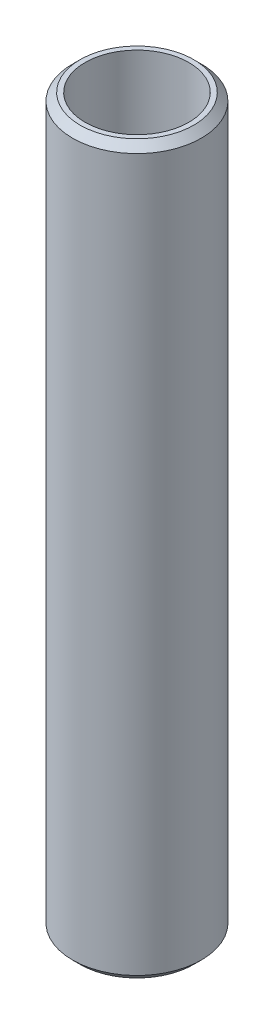
ISO-10303-21;
HEADER;
FILE_DESCRIPTION(('STEP AP214'),'2;1');
FILE_NAME('part.step','',(''),(''),'','','');
FILE_SCHEMA(('AUTOMOTIVE_DESIGN { 1 0 10303 214 1 1 1 1 }'));
ENDSEC;
DATA;
#1=APPLICATION_CONTEXT('core data for automotive mechanical design processes');
#2=APPLICATION_PROTOCOL_DEFINITION('international standard','automotive_design',2000,#1);
#3=PRODUCT_CONTEXT('',#1,'mechanical');
#4=PRODUCT('Part','Part','',(#3));
#5=PRODUCT_RELATED_PRODUCT_CATEGORY('part','',(#4));
#6=PRODUCT_DEFINITION_FORMATION('','',#4);
#7=PRODUCT_DEFINITION_CONTEXT('part definition',#1,'design');
#8=PRODUCT_DEFINITION('design','',#6,#7);
#9=PRODUCT_DEFINITION_SHAPE('','',#8);
#10=(LENGTH_UNIT() NAMED_UNIT(*) SI_UNIT(.MILLI.,.METRE.));
#11=(NAMED_UNIT(*) PLANE_ANGLE_UNIT() SI_UNIT($,.RADIAN.));
#12=(NAMED_UNIT(*) SI_UNIT($,.STERADIAN.) SOLID_ANGLE_UNIT());
#13=UNCERTAINTY_MEASURE_WITH_UNIT(LENGTH_MEASURE(1.E-05),#10,'distance_accuracy_value','');
#14=(GEOMETRIC_REPRESENTATION_CONTEXT(3) GLOBAL_UNCERTAINTY_ASSIGNED_CONTEXT((#13)) GLOBAL_UNIT_ASSIGNED_CONTEXT((#10,
#11,#12)) REPRESENTATION_CONTEXT('',''));
#15=CARTESIAN_POINT('',(0.,0.,0.));
#16=DIRECTION('',(0.,0.,1.));
#17=DIRECTION('',(1.,0.,0.));
#18=AXIS2_PLACEMENT_3D('',#15,#16,#17);
#19=CARTESIAN_POINT('',(0.,310.607577266142,0.));
#20=DIRECTION('',(0.,-1.,0.));
#21=DIRECTION('',(0.,0.,-1.));
#22=AXIS2_PLACEMENT_3D('',#19,#20,#21);
#23=CYLINDRICAL_SURFACE('',#22,27.5);
#24=CARTESIAN_POINT('',(0.,307.389904475116,0.));
#25=DIRECTION('',(0.,1.,0.));
#26=DIRECTION('',(0.,0.,1.));
#27=AXIS2_PLACEMENT_3D('',#24,#25,#26);
#28=CIRCLE('',#27,27.5);
#29=CARTESIAN_POINT('',(0.,307.389904475116,27.5));
#30=VERTEX_POINT('',#29);
#31=EDGE_CURVE('E50',#30,#30,#28,.F.);
#32=ORIENTED_EDGE('',*,*,#31,.T.);
#33=EDGE_LOOP('',(#32));
#34=FACE_BOUND('',#33,.T.);
#35=CARTESIAN_POINT('',(0.,3.21767279102597,0.));
#36=DIRECTION('',(0.,1.,0.));
#37=DIRECTION('',(0.,0.,1.));
#38=AXIS2_PLACEMENT_3D('',#35,#36,#37);
#39=CIRCLE('',#38,27.5);
#40=CARTESIAN_POINT('',(0.,3.21767279102597,27.5));
#41=VERTEX_POINT('',#40);
#42=EDGE_CURVE('E51',#41,#41,#39,.T.);
#43=ORIENTED_EDGE('',*,*,#42,.T.);
#44=EDGE_LOOP('',(#43));
#45=FACE_BOUND('',#44,.T.);
#46=ADVANCED_FACE('F39',(#34,#45),#23,.T.);
#47=CARTESIAN_POINT('',(0.,310.607577266142,0.));
#48=DIRECTION('',(0.,1.,0.));
#49=DIRECTION('',(0.,0.,1.));
#50=AXIS2_PLACEMENT_3D('',#47,#48,#49);
#51=PLANE('',#50);
#52=CARTESIAN_POINT('',(0.,310.607577266142,0.));
#53=DIRECTION('',(0.,1.,0.));
#54=DIRECTION('',(0.,0.,1.));
#55=AXIS2_PLACEMENT_3D('',#52,#53,#54);
#56=CIRCLE('',#55,24.2823272089738);
#57=CARTESIAN_POINT('',(0.,310.607577266142,24.2823272089738));
#58=VERTEX_POINT('',#57);
#59=EDGE_CURVE('E54',#58,#58,#56,.T.);
#60=ORIENTED_EDGE('',*,*,#59,.T.);
#61=EDGE_LOOP('',(#60));
#62=FACE_BOUND('',#61,.T.);
#63=CARTESIAN_POINT('',(0.,310.607577266142,0.));
#64=DIRECTION('',(0.,1.,0.));
#65=DIRECTION('',(0.,0.,1.));
#66=AXIS2_PLACEMENT_3D('',#63,#64,#65);
#67=CIRCLE('',#66,22.1614896383112);
#68=CARTESIAN_POINT('',(0.,310.607577266142,22.1614896383112));
#69=VERTEX_POINT('',#68);
#70=EDGE_CURVE('E58',#69,#69,#67,.T.);
#71=ORIENTED_EDGE('',*,*,#70,.F.);
#72=EDGE_LOOP('',(#71));
#73=FACE_BOUND('',#72,.T.);
#74=ADVANCED_FACE('F69',(#62,#73),#51,.T.);
#75=CARTESIAN_POINT('',(0.,0.,0.));
#76=DIRECTION('',(0.,1.,0.));
#77=DIRECTION('',(0.,0.,1.));
#78=AXIS2_PLACEMENT_3D('',#75,#76,#77);
#79=PLANE('',#78);
#80=CARTESIAN_POINT('',(0.,0.,0.));
#81=DIRECTION('',(0.,1.,0.));
#82=DIRECTION('',(0.,0.,1.));
#83=AXIS2_PLACEMENT_3D('',#80,#81,#82);
#84=CIRCLE('',#83,24.282327208974);
#85=CARTESIAN_POINT('',(0.,0.,24.282327208974));
#86=VERTEX_POINT('',#85);
#87=EDGE_CURVE('E10',#86,#86,#84,.F.);
#88=ORIENTED_EDGE('',*,*,#87,.T.);
#89=EDGE_LOOP('',(#88));
#90=FACE_BOUND('',#89,.T.);
#91=CARTESIAN_POINT('',(0.,0.,0.));
#92=DIRECTION('',(0.,1.,0.));
#93=DIRECTION('',(0.,0.,1.));
#94=AXIS2_PLACEMENT_3D('',#91,#92,#93);
#95=CIRCLE('',#94,22.1614896383112);
#96=CARTESIAN_POINT('',(0.,0.,22.1614896383112));
#97=VERTEX_POINT('',#96);
#98=EDGE_CURVE('E63',#97,#97,#95,.T.);
#99=ORIENTED_EDGE('',*,*,#98,.T.);
#100=EDGE_LOOP('',(#99));
#101=FACE_BOUND('',#100,.T.);
#102=ADVANCED_FACE('F75',(#90,#101),#79,.F.);
#103=CARTESIAN_POINT('',(0.,310.607577266142,0.));
#104=DIRECTION('',(0.,-1.,0.));
#105=DIRECTION('',(0.,0.,-1.));
#106=AXIS2_PLACEMENT_3D('',#103,#104,#105);
#107=CYLINDRICAL_SURFACE('',#106,22.1614896383112);
#108=ORIENTED_EDGE('',*,*,#70,.T.);
#109=EDGE_LOOP('',(#108));
#110=FACE_BOUND('',#109,.T.);
#111=ORIENTED_EDGE('',*,*,#98,.F.);
#112=EDGE_LOOP('',(#111));
#113=FACE_BOUND('',#112,.T.);
#114=ADVANCED_FACE('F70',(#110,#113),#107,.F.);
#115=CARTESIAN_POINT('',(0.,310.607577266142,0.));
#116=DIRECTION('',(0.,-1.,0.));
#117=DIRECTION('',(0.,0.,-1.));
#118=AXIS2_PLACEMENT_3D('',#115,#116,#117);
#119=CONICAL_SURFACE('',#118,24.2823272089738,0.785398163397445);
#120=ORIENTED_EDGE('',*,*,#31,.F.);
#121=EDGE_LOOP('',(#120));
#122=FACE_BOUND('',#121,.T.);
#123=ORIENTED_EDGE('',*,*,#59,.F.);
#124=EDGE_LOOP('',(#123));
#125=FACE_BOUND('',#124,.T.);
#126=ADVANCED_FACE('F81',(#122,#125),#119,.T.);
#127=CARTESIAN_POINT('',(0.,3.21767279102597,0.));
#128=DIRECTION('',(0.,1.,0.));
#129=DIRECTION('',(0.,0.,1.));
#130=AXIS2_PLACEMENT_3D('',#127,#128,#129);
#131=CONICAL_SURFACE('',#130,27.5,0.785398163397458);
#132=CARTESIAN_POINT('',(0.,0.,24.282327208974));
#133=CARTESIAN_POINT('',(0.,0.0335174249065201,24.3158446338805));
#134=CARTESIAN_POINT('',(0.,0.0670348498130407,24.349362058787));
#135=CARTESIAN_POINT('',(0.,0.134069699626082,24.4163969086001));
#136=CARTESIAN_POINT('',(0.,0.167587124532602,24.4499143335066));
#137=CARTESIAN_POINT('',(0.,0.234621974345643,24.5169491833196));
#138=CARTESIAN_POINT('',(0.,0.268139399252164,24.5504666082261));
#139=CARTESIAN_POINT('',(0.,0.335174249065205,24.6175014580392));
#140=CARTESIAN_POINT('',(0.,0.368691673971726,24.6510188829457));
#141=CARTESIAN_POINT('',(0.,0.435726523784767,24.7180537327587));
#142=CARTESIAN_POINT('',(0.,0.469243948691287,24.7515711576653));
#143=CARTESIAN_POINT('',(0.,0.536278798504328,24.8186060074783));
#144=CARTESIAN_POINT('',(0.,0.569796223410849,24.8521234323848));
#145=CARTESIAN_POINT('',(0.,0.63683107322389,24.9191582821979));
#146=CARTESIAN_POINT('',(0.,0.67034849813041,24.9526757071044));
#147=CARTESIAN_POINT('',(0.,0.737383347943451,25.0197105569174));
#148=CARTESIAN_POINT('',(0.,0.770900772849972,25.053227981824));
#149=CARTESIAN_POINT('',(0.,0.837935622663013,25.120262831637));
#150=CARTESIAN_POINT('',(0.,0.871453047569534,25.1537802565435));
#151=CARTESIAN_POINT('',(0.,0.938487897382575,25.2208151063566));
#152=CARTESIAN_POINT('',(0.,0.972005322289095,25.2543325312631));
#153=CARTESIAN_POINT('',(0.,1.03904017210214,25.3213673810761));
#154=CARTESIAN_POINT('',(0.,1.07255759700866,25.3548848059826));
#155=CARTESIAN_POINT('',(0.,1.1395924468217,25.4219196557957));
#156=CARTESIAN_POINT('',(0.,1.17310987172822,25.4554370807022));
#157=CARTESIAN_POINT('',(0.,1.24014472154126,25.5224719305153));
#158=CARTESIAN_POINT('',(0.,1.27366214644778,25.5559893554218));
#159=CARTESIAN_POINT('',(0.,1.34069699626082,25.6230242052348));
#160=CARTESIAN_POINT('',(0.,1.37421442116734,25.6565416301413));
#161=CARTESIAN_POINT('',(0.,1.44124927098038,25.7235764799544));
#162=CARTESIAN_POINT('',(0.,1.4747666958869,25.7570939048609));
#163=CARTESIAN_POINT('',(0.,1.54180154569994,25.8241287546739));
#164=CARTESIAN_POINT('',(0.,1.57531897060646,25.8576461795805));
#165=CARTESIAN_POINT('',(0.,1.64235382041951,25.9246810293935));
#166=CARTESIAN_POINT('',(0.,1.67587124532603,25.9581984543));
#167=CARTESIAN_POINT('',(0.,1.74290609513907,26.0252333041131));
#168=CARTESIAN_POINT('',(0.,1.77642352004559,26.0587507290196));
#169=CARTESIAN_POINT('',(0.,1.84345836985863,26.1257855788326));
#170=CARTESIAN_POINT('',(0.,1.87697579476515,26.1593030037392));
#171=CARTESIAN_POINT('',(0.,1.94401064457819,26.2263378535522));
#172=CARTESIAN_POINT('',(0.,1.97752806948471,26.2598552784587));
#173=CARTESIAN_POINT('',(0.,2.04456291929775,26.3268901282718));
#174=CARTESIAN_POINT('',(0.,2.07808034420427,26.3604075531783));
#175=CARTESIAN_POINT('',(0.,2.14511519401731,26.4274424029913));
#176=CARTESIAN_POINT('',(0.,2.17863261892384,26.4609598278978));
#177=CARTESIAN_POINT('',(0.,2.24566746873688,26.5279946777109));
#178=CARTESIAN_POINT('',(0.,2.2791848936434,26.5615121026174));
#179=CARTESIAN_POINT('',(0.,2.34621974345644,26.6285469524305));
#180=CARTESIAN_POINT('',(0.,2.37973716836296,26.662064377337));
#181=CARTESIAN_POINT('',(0.,2.446772018176,26.72909922715));
#182=CARTESIAN_POINT('',(0.,2.48028944308252,26.7626166520565));
#183=CARTESIAN_POINT('',(0.,2.54732429289556,26.8296515018696));
#184=CARTESIAN_POINT('',(0.,2.58084171780208,26.8631689267761));
#185=CARTESIAN_POINT('',(0.,2.64787656761512,26.9302037765891));
#186=CARTESIAN_POINT('',(0.,2.68139399252164,26.9637212014957));
#187=CARTESIAN_POINT('',(0.,2.74842884233468,27.0307560513087));
#188=CARTESIAN_POINT('',(0.,2.7819462672412,27.0642734762152));
#189=CARTESIAN_POINT('',(0.,2.84898111705425,27.1313083260283));
#190=CARTESIAN_POINT('',(0.,2.88249854196077,27.1648257509348));
#191=CARTESIAN_POINT('',(0.,2.94953339177381,27.2318606007478));
#192=CARTESIAN_POINT('',(0.,2.98305081668033,27.2653780256544));
#193=CARTESIAN_POINT('',(0.,3.05008566649337,27.3324128754674));
#194=CARTESIAN_POINT('',(0.,3.08360309139989,27.3659303003739));
#195=CARTESIAN_POINT('',(0.,3.15063794121293,27.432965150187));
#196=CARTESIAN_POINT('',(0.,3.18415536611945,27.4664825750935));
#197=CARTESIAN_POINT('',(0.,3.21767279102597,27.5));
#198=B_SPLINE_CURVE_WITH_KNOTS('',3,(#132,#133,#134,#135,#136,#137,#138,#139,#140,#141,#142,
#143,#144,#145,#146,#147,#148,#149,#150,#151,#152,#153,#154,#155,#156,#157,#158,#159,#160,#161,
#162,#163,#164,#165,#166,#167,#168,#169,#170,#171,#172,#173,#174,#175,#176,#177,#178,#179,#180,
#181,#182,#183,#184,#185,#186,#187,#188,#189,#190,#191,#192,#193,#194,#195,#196,#197),
.UNSPECIFIED.,.F.,.F.,(4,2,2,2,2,2,2,2,2,2,2,2,2,2,2,2,2,2,2,2,2,2,2,2,2,2,2,2,2,2,2,2,4),(0.,
0.142202390635871,0.284404781271741,0.426607171907612,0.568809562543482,0.711011953179353,
0.853214343815223,0.995416734451094,1.13761912508696,1.27982151572284,1.42202390635871,
1.56422629699458,1.70642868763045,1.84863107826632,1.99083346890219,2.13303585953806,
2.27523825017393,2.4174406408098,2.55964303144567,2.70184542208154,2.84404781271741,
2.98625020335328,3.12845259398916,3.27065498462503,3.4128573752609,3.55505976589677,
3.69726215653264,3.83946454716851,3.98166693780438,4.12386932844025,4.26607171907612,
4.40827410971199,4.55047650034786),.UNSPECIFIED.);
#199=EDGE_CURVE('BSEAM45',#86,#41,#198,.T.);
#200=ORIENTED_EDGE('',*,*,#87,.F.);
#201=ORIENTED_EDGE('',*,*,#42,.F.);
#202=ORIENTED_EDGE('',*,*,#199,.T.);
#203=ORIENTED_EDGE('',*,*,#199,.F.);
#204=EDGE_LOOP('',(#200,#202,#201,#203));
#205=FACE_BOUND('',#204,.T.);
#206=ADVANCED_FACE('F45',(#205),#131,.T.);
#207=CLOSED_SHELL('',(#46,#74,#102,#114,#126,#206));
#208=MANIFOLD_SOLID_BREP('B2',#207);
#209=ADVANCED_BREP_SHAPE_REPRESENTATION('',(#18,#208),#14);
#210=SHAPE_DEFINITION_REPRESENTATION(#9,#209);
ENDSEC;
END-ISO-10303-21;
